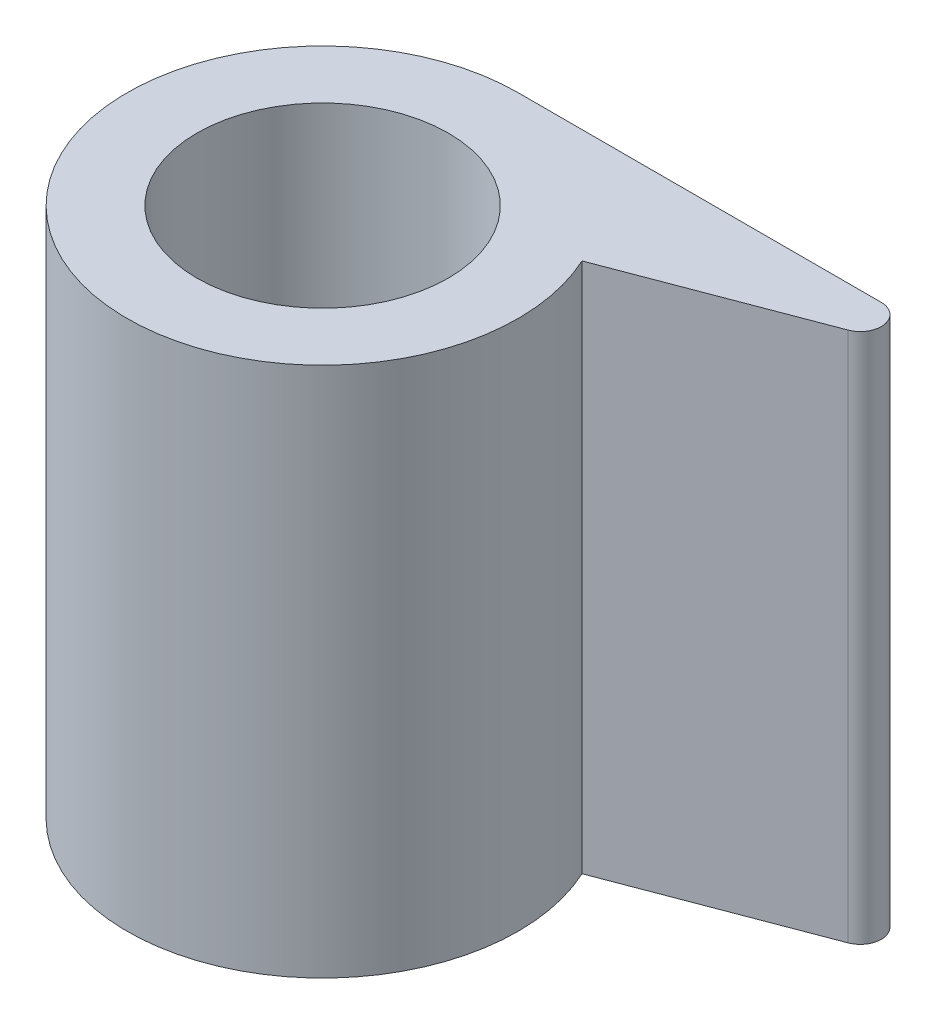
ISO-10303-21;
HEADER;
FILE_DESCRIPTION(('STEP AP214'),'2;1');
FILE_NAME('part.step','',(''),(''),'','','');
FILE_SCHEMA(('AUTOMOTIVE_DESIGN { 1 0 10303 214 1 1 1 1 }'));
ENDSEC;
DATA;
#1=APPLICATION_CONTEXT('core data for automotive mechanical design processes');
#2=APPLICATION_PROTOCOL_DEFINITION('international standard','automotive_design',2000,#1);
#3=PRODUCT_CONTEXT('',#1,'mechanical');
#4=PRODUCT('Part','Part','',(#3));
#5=PRODUCT_RELATED_PRODUCT_CATEGORY('part','',(#4));
#6=PRODUCT_DEFINITION_FORMATION('','',#4);
#7=PRODUCT_DEFINITION_CONTEXT('part definition',#1,'design');
#8=PRODUCT_DEFINITION('design','',#6,#7);
#9=PRODUCT_DEFINITION_SHAPE('','',#8);
#10=(LENGTH_UNIT() NAMED_UNIT(*) SI_UNIT(.MILLI.,.METRE.));
#11=(NAMED_UNIT(*) PLANE_ANGLE_UNIT() SI_UNIT($,.RADIAN.));
#12=(NAMED_UNIT(*) SI_UNIT($,.STERADIAN.) SOLID_ANGLE_UNIT());
#13=UNCERTAINTY_MEASURE_WITH_UNIT(LENGTH_MEASURE(1.E-05),#10,'distance_accuracy_value','');
#14=(GEOMETRIC_REPRESENTATION_CONTEXT(3) GLOBAL_UNCERTAINTY_ASSIGNED_CONTEXT((#13)) GLOBAL_UNIT_ASSIGNED_CONTEXT((#10,
#11,#12)) REPRESENTATION_CONTEXT('',''));
#15=CARTESIAN_POINT('',(0.,0.,0.));
#16=DIRECTION('',(0.,0.,1.));
#17=DIRECTION('',(1.,0.,0.));
#18=AXIS2_PLACEMENT_3D('',#15,#16,#17);
#19=CARTESIAN_POINT('',(-13.873049234522,19.,-1.11689803159287));
#20=DIRECTION('',(0.,-1.,0.));
#21=DIRECTION('',(0.,0.,-1.));
#22=AXIS2_PLACEMENT_3D('',#19,#20,#21);
#23=CYLINDRICAL_SURFACE('',#22,7.);
#24=CARTESIAN_POINT('',(-13.873049234522,0.,-1.11689803159287));
#25=DIRECTION('',(0.,1.,0.));
#26=DIRECTION('',(0.,0.,1.));
#27=AXIS2_PLACEMENT_3D('',#24,#25,#26);
#28=CIRCLE('',#27,7.);
#29=CARTESIAN_POINT('',(-13.873049234522,0.,-8.11689803159287));
#30=VERTEX_POINT('',#29);
#31=CARTESIAN_POINT('',(-7.51517248243006,0.,-4.04561843566176));
#32=VERTEX_POINT('',#31);
#33=EDGE_CURVE('E96',#30,#32,#28,.T.);
#34=ORIENTED_EDGE('',*,*,#33,.T.);
#35=DIRECTION('',(0.,-1.,0.));
#36=VECTOR('',#35,1.);
#37=CARTESIAN_POINT('',(-7.51517248243006,19.,-4.04561843566176));
#38=LINE('',#37,#36);
#39=CARTESIAN_POINT('',(-7.51517248243006,19.,-4.04561843566176));
#40=VERTEX_POINT('',#39);
#41=EDGE_CURVE('E11',#40,#32,#38,.T.);
#42=ORIENTED_EDGE('',*,*,#41,.F.);
#43=CARTESIAN_POINT('',(-13.873049234522,19.,-1.11689803159287));
#44=DIRECTION('',(0.,1.,0.));
#45=DIRECTION('',(0.,0.,1.));
#46=AXIS2_PLACEMENT_3D('',#43,#44,#45);
#47=CIRCLE('',#46,7.);
#48=CARTESIAN_POINT('',(-13.873049234522,19.,-8.11689803159287));
#49=VERTEX_POINT('',#48);
#50=EDGE_CURVE('E84',#49,#40,#47,.T.);
#51=ORIENTED_EDGE('',*,*,#50,.F.);
#52=DIRECTION('',(0.,-1.,0.));
#53=VECTOR('',#52,1.);
#54=CARTESIAN_POINT('',(-13.873049234522,19.,-8.11689803159287));
#55=LINE('',#54,#53);
#56=EDGE_CURVE('E92',#49,#30,#55,.T.);
#57=ORIENTED_EDGE('',*,*,#56,.T.);
#58=EDGE_LOOP('',(#34,#42,#51,#57));
#59=FACE_BOUND('',#58,.T.);
#60=ADVANCED_FACE('F33',(#59),#23,.T.);
#61=CARTESIAN_POINT('',(-0.607084084000558,19.,-6.66564020546318));
#62=DIRECTION('',(-0.354620200695191,0.,-0.935010434839581));
#63=DIRECTION('',(-0.935010434839581,0.,0.354620200695191));
#64=AXIS2_PLACEMENT_3D('',#61,#62,#63);
#65=PLANE('',#64);
#66=DIRECTION('',(0.935010434839581,0.,-0.354620200695191));
#67=VECTOR('',#66,1.);
#68=CARTESIAN_POINT('',(-0.607084084000558,0.,-6.66564020546318));
#69=LINE('',#68,#67);
#70=CARTESIAN_POINT('',(-0.607084084000558,0.,-6.66564020546318));
#71=VERTEX_POINT('',#70);
#72=EDGE_CURVE('E88',#32,#71,#69,.T.);
#73=ORIENTED_EDGE('',*,*,#72,.T.);
#74=DIRECTION('',(0.,-1.,0.));
#75=VECTOR('',#74,1.);
#76=CARTESIAN_POINT('',(-0.607084084000558,19.,-6.66564020546318));
#77=LINE('',#76,#75);
#78=CARTESIAN_POINT('',(-0.607084084000558,19.,-6.66564020546318));
#79=VERTEX_POINT('',#78);
#80=EDGE_CURVE('E41',#79,#71,#77,.T.);
#81=ORIENTED_EDGE('',*,*,#80,.F.);
#82=DIRECTION('',(0.935010434839581,0.,-0.354620200695191));
#83=VECTOR('',#82,1.);
#84=CARTESIAN_POINT('',(-0.607084084000558,19.,-6.66564020546318));
#85=LINE('',#84,#83);
#86=EDGE_CURVE('E79',#40,#79,#85,.T.);
#87=ORIENTED_EDGE('',*,*,#86,.F.);
#88=ORIENTED_EDGE('',*,*,#41,.T.);
#89=EDGE_LOOP('',(#73,#81,#87,#88));
#90=FACE_BOUND('',#89,.T.);
#91=ADVANCED_FACE('F87',(#90),#65,.F.);
#92=CARTESIAN_POINT('',(-0.873049234521951,19.,-7.36689803159287));
#93=DIRECTION('',(0.,-1.,0.));
#94=DIRECTION('',(0.,0.,-1.));
#95=AXIS2_PLACEMENT_3D('',#92,#93,#94);
#96=CYLINDRICAL_SURFACE('',#95,0.75);
#97=CARTESIAN_POINT('',(-0.873049234521951,0.,-7.36689803159287));
#98=DIRECTION('',(0.,1.,0.));
#99=DIRECTION('',(0.,0.,-1.));
#100=AXIS2_PLACEMENT_3D('',#97,#98,#99);
#101=CIRCLE('',#100,0.75);
#102=CARTESIAN_POINT('',(-0.873049234521951,0.,-8.11689803159287));
#103=VERTEX_POINT('',#102);
#104=EDGE_CURVE('E66',#71,#103,#101,.T.);
#105=ORIENTED_EDGE('',*,*,#104,.T.);
#106=DIRECTION('',(0.,-1.,0.));
#107=VECTOR('',#106,1.);
#108=CARTESIAN_POINT('',(-0.873049234521951,19.,-8.11689803159287));
#109=LINE('',#108,#107);
#110=CARTESIAN_POINT('',(-0.873049234521951,19.,-8.11689803159287));
#111=VERTEX_POINT('',#110);
#112=EDGE_CURVE('E89',#111,#103,#109,.T.);
#113=ORIENTED_EDGE('',*,*,#112,.F.);
#114=CARTESIAN_POINT('',(-0.873049234521951,19.,-7.36689803159287));
#115=DIRECTION('',(0.,1.,0.));
#116=DIRECTION('',(0.,0.,-1.));
#117=AXIS2_PLACEMENT_3D('',#114,#115,#116);
#118=CIRCLE('',#117,0.75);
#119=EDGE_CURVE('E82',#79,#111,#118,.T.);
#120=ORIENTED_EDGE('',*,*,#119,.F.);
#121=ORIENTED_EDGE('',*,*,#80,.T.);
#122=EDGE_LOOP('',(#105,#113,#120,#121));
#123=FACE_BOUND('',#122,.T.);
#124=ADVANCED_FACE('F90',(#123),#96,.T.);
#125=CARTESIAN_POINT('',(-13.873049234522,19.,-8.11689803159287));
#126=DIRECTION('',(0.,0.,1.));
#127=DIRECTION('',(1.,0.,0.));
#128=AXIS2_PLACEMENT_3D('',#125,#126,#127);
#129=PLANE('',#128);
#130=DIRECTION('',(-1.,0.,0.));
#131=VECTOR('',#130,1.);
#132=CARTESIAN_POINT('',(-13.873049234522,0.,-8.11689803159287));
#133=LINE('',#132,#131);
#134=EDGE_CURVE('E72',#103,#30,#133,.T.);
#135=ORIENTED_EDGE('',*,*,#134,.T.);
#136=ORIENTED_EDGE('',*,*,#56,.F.);
#137=DIRECTION('',(-1.,0.,0.));
#138=VECTOR('',#137,1.);
#139=CARTESIAN_POINT('',(-13.873049234522,19.,-8.11689803159287));
#140=LINE('',#139,#138);
#141=EDGE_CURVE('E49',#111,#49,#140,.T.);
#142=ORIENTED_EDGE('',*,*,#141,.F.);
#143=ORIENTED_EDGE('',*,*,#112,.T.);
#144=EDGE_LOOP('',(#135,#136,#142,#143));
#145=FACE_BOUND('',#144,.T.);
#146=ADVANCED_FACE('F104',(#145),#129,.F.);
#147=CARTESIAN_POINT('',(-13.873049234522,19.,-1.11689803159287));
#148=DIRECTION('',(0.,1.,0.));
#149=DIRECTION('',(0.,0.,1.));
#150=AXIS2_PLACEMENT_3D('',#147,#148,#149);
#151=PLANE('',#150);
#152=CARTESIAN_POINT('',(-13.873049234522,19.,-1.11689803159287));
#153=DIRECTION('',(0.,1.,0.));
#154=DIRECTION('',(0.,0.,1.));
#155=AXIS2_PLACEMENT_3D('',#152,#153,#154);
#156=CIRCLE('',#155,4.5);
#157=CARTESIAN_POINT('',(-13.873049234522,19.,3.38310196840713));
#158=VERTEX_POINT('',#157);
#159=EDGE_CURVE('E110',#158,#158,#156,.T.);
#160=ORIENTED_EDGE('',*,*,#159,.F.);
#161=EDGE_LOOP('',(#160));
#162=FACE_BOUND('',#161,.T.);
#163=ORIENTED_EDGE('',*,*,#50,.T.);
#164=ORIENTED_EDGE('',*,*,#86,.T.);
#165=ORIENTED_EDGE('',*,*,#119,.T.);
#166=ORIENTED_EDGE('',*,*,#141,.T.);
#167=EDGE_LOOP('',(#163,#164,#165,#166));
#168=FACE_BOUND('',#167,.T.);
#169=ADVANCED_FACE('F80',(#162,#168),#151,.T.);
#170=CARTESIAN_POINT('',(-13.873049234522,0.,-1.11689803159287));
#171=DIRECTION('',(0.,1.,0.));
#172=DIRECTION('',(0.,0.,1.));
#173=AXIS2_PLACEMENT_3D('',#170,#171,#172);
#174=PLANE('',#173);
#175=CARTESIAN_POINT('',(-13.873049234522,0.,-1.11689803159287));
#176=DIRECTION('',(0.,1.,0.));
#177=DIRECTION('',(0.,0.,1.));
#178=AXIS2_PLACEMENT_3D('',#175,#176,#177);
#179=CIRCLE('',#178,4.5);
#180=CARTESIAN_POINT('',(-13.873049234522,0.,3.38310196840713));
#181=VERTEX_POINT('',#180);
#182=EDGE_CURVE('E99',#181,#181,#179,.T.);
#183=ORIENTED_EDGE('',*,*,#182,.T.);
#184=EDGE_LOOP('',(#183));
#185=FACE_BOUND('',#184,.T.);
#186=ORIENTED_EDGE('',*,*,#33,.F.);
#187=ORIENTED_EDGE('',*,*,#134,.F.);
#188=ORIENTED_EDGE('',*,*,#104,.F.);
#189=ORIENTED_EDGE('',*,*,#72,.F.);
#190=EDGE_LOOP('',(#186,#187,#188,#189));
#191=FACE_BOUND('',#190,.T.);
#192=ADVANCED_FACE('F107',(#185,#191),#174,.F.);
#193=CARTESIAN_POINT('',(-13.873049234522,0.,-1.11689803159287));
#194=DIRECTION('',(0.,1.,0.));
#195=DIRECTION('',(0.,0.,1.));
#196=AXIS2_PLACEMENT_3D('',#193,#194,#195);
#197=CYLINDRICAL_SURFACE('',#196,4.5);
#198=ORIENTED_EDGE('',*,*,#182,.F.);
#199=EDGE_LOOP('',(#198));
#200=FACE_BOUND('',#199,.T.);
#201=ORIENTED_EDGE('',*,*,#159,.T.);
#202=EDGE_LOOP('',(#201));
#203=FACE_BOUND('',#202,.T.);
#204=ADVANCED_FACE('F117',(#200,#203),#197,.F.);
#205=CLOSED_SHELL('',(#60,#91,#124,#146,#169,#192,#204));
#206=MANIFOLD_SOLID_BREP('B2',#205);
#207=ADVANCED_BREP_SHAPE_REPRESENTATION('',(#18,#206),#14);
#208=SHAPE_DEFINITION_REPRESENTATION(#9,#207);
ENDSEC;
END-ISO-10303-21;
